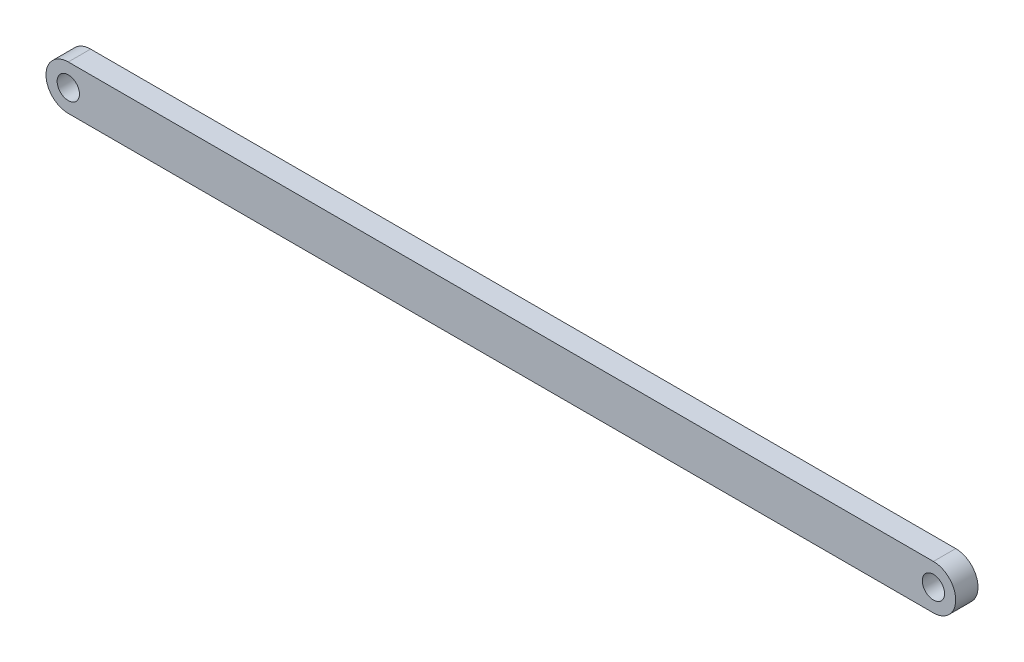
ISO-10303-21;
HEADER;
FILE_DESCRIPTION(('STEP AP214'),'2;1');
FILE_NAME('part.step','',(''),(''),'','','');
FILE_SCHEMA(('AUTOMOTIVE_DESIGN { 1 0 10303 214 1 1 1 1 }'));
ENDSEC;
DATA;
#1=APPLICATION_CONTEXT('core data for automotive mechanical design processes');
#2=APPLICATION_PROTOCOL_DEFINITION('international standard','automotive_design',2000,#1);
#3=PRODUCT_CONTEXT('',#1,'mechanical');
#4=PRODUCT('Part','Part','',(#3));
#5=PRODUCT_RELATED_PRODUCT_CATEGORY('part','',(#4));
#6=PRODUCT_DEFINITION_FORMATION('','',#4);
#7=PRODUCT_DEFINITION_CONTEXT('part definition',#1,'design');
#8=PRODUCT_DEFINITION('design','',#6,#7);
#9=PRODUCT_DEFINITION_SHAPE('','',#8);
#10=(LENGTH_UNIT() NAMED_UNIT(*) SI_UNIT(.MILLI.,.METRE.));
#11=(NAMED_UNIT(*) PLANE_ANGLE_UNIT() SI_UNIT($,.RADIAN.));
#12=(NAMED_UNIT(*) SI_UNIT($,.STERADIAN.) SOLID_ANGLE_UNIT());
#13=UNCERTAINTY_MEASURE_WITH_UNIT(LENGTH_MEASURE(1.E-05),#10,'distance_accuracy_value','');
#14=(GEOMETRIC_REPRESENTATION_CONTEXT(3) GLOBAL_UNCERTAINTY_ASSIGNED_CONTEXT((#13)) GLOBAL_UNIT_ASSIGNED_CONTEXT((#10,
#11,#12)) REPRESENTATION_CONTEXT('',''));
#15=CARTESIAN_POINT('',(0.,0.,0.));
#16=DIRECTION('',(0.,0.,1.));
#17=DIRECTION('',(1.,0.,0.));
#18=AXIS2_PLACEMENT_3D('',#15,#16,#17);
#19=CARTESIAN_POINT('',(388.,0.,10.));
#20=DIRECTION('',(0.,0.,-1.));
#21=DIRECTION('',(-1.,0.,0.));
#22=AXIS2_PLACEMENT_3D('',#19,#20,#21);
#23=CYLINDRICAL_SURFACE('',#22,10.);
#24=CARTESIAN_POINT('',(388.,0.,0.));
#25=DIRECTION('',(0.,0.,-1.));
#26=DIRECTION('',(-1.,0.,0.));
#27=AXIS2_PLACEMENT_3D('',#24,#25,#26);
#28=CIRCLE('',#27,10.);
#29=CARTESIAN_POINT('',(388.,9.99999999999999,0.));
#30=VERTEX_POINT('',#29);
#31=CARTESIAN_POINT('',(388.,-10.,0.));
#32=VERTEX_POINT('',#31);
#33=EDGE_CURVE('E141',#30,#32,#28,.T.);
#34=ORIENTED_EDGE('',*,*,#33,.F.);
#35=DIRECTION('',(0.,0.,-1.));
#36=VECTOR('',#35,1.);
#37=CARTESIAN_POINT('',(388.,9.99999999999999,10.));
#38=LINE('',#37,#36);
#39=CARTESIAN_POINT('',(388.,9.99999999999999,10.));
#40=VERTEX_POINT('',#39);
#41=EDGE_CURVE('E11',#40,#30,#38,.T.);
#42=ORIENTED_EDGE('',*,*,#41,.F.);
#43=CARTESIAN_POINT('',(388.,0.,10.));
#44=DIRECTION('',(0.,0.,-1.));
#45=DIRECTION('',(-1.,0.,0.));
#46=AXIS2_PLACEMENT_3D('',#43,#44,#45);
#47=CIRCLE('',#46,10.);
#48=CARTESIAN_POINT('',(388.,-10.,10.));
#49=VERTEX_POINT('',#48);
#50=EDGE_CURVE('E114',#40,#49,#47,.T.);
#51=ORIENTED_EDGE('',*,*,#50,.T.);
#52=DIRECTION('',(0.,0.,-1.));
#53=VECTOR('',#52,1.);
#54=CARTESIAN_POINT('',(388.,-10.,10.));
#55=LINE('',#54,#53);
#56=EDGE_CURVE('E46',#49,#32,#55,.T.);
#57=ORIENTED_EDGE('',*,*,#56,.T.);
#58=EDGE_LOOP('',(#34,#42,#51,#57));
#59=FACE_BOUND('',#58,.T.);
#60=ADVANCED_FACE('F30',(#59),#23,.T.);
#61=CARTESIAN_POINT('',(-123.871999047463,10.,10.));
#62=DIRECTION('',(0.,-1.,0.));
#63=DIRECTION('',(1.,0.,0.));
#64=AXIS2_PLACEMENT_3D('',#61,#62,#63);
#65=PLANE('',#64);
#66=DIRECTION('',(-1.,0.,0.));
#67=VECTOR('',#66,1.);
#68=CARTESIAN_POINT('',(-123.871999047463,10.,0.));
#69=LINE('',#68,#67);
#70=CARTESIAN_POINT('',(0.,10.,0.));
#71=VERTEX_POINT('',#70);
#72=EDGE_CURVE('E138',#30,#71,#69,.T.);
#73=ORIENTED_EDGE('',*,*,#72,.T.);
#74=DIRECTION('',(0.,0.,-1.));
#75=VECTOR('',#74,1.);
#76=CARTESIAN_POINT('',(0.,10.,10.));
#77=LINE('',#76,#75);
#78=CARTESIAN_POINT('',(0.,10.,10.));
#79=VERTEX_POINT('',#78);
#80=EDGE_CURVE('E38',#79,#71,#77,.T.);
#81=ORIENTED_EDGE('',*,*,#80,.F.);
#82=DIRECTION('',(-1.,0.,0.));
#83=VECTOR('',#82,1.);
#84=CARTESIAN_POINT('',(-123.871999047463,10.,10.));
#85=LINE('',#84,#83);
#86=EDGE_CURVE('E112',#40,#79,#85,.T.);
#87=ORIENTED_EDGE('',*,*,#86,.F.);
#88=ORIENTED_EDGE('',*,*,#41,.T.);
#89=EDGE_LOOP('',(#73,#81,#87,#88));
#90=FACE_BOUND('',#89,.T.);
#91=ADVANCED_FACE('F139',(#90),#65,.F.);
#92=CARTESIAN_POINT('',(0.,0.,10.));
#93=DIRECTION('',(0.,0.,-1.));
#94=DIRECTION('',(-1.,0.,0.));
#95=AXIS2_PLACEMENT_3D('',#92,#93,#94);
#96=CYLINDRICAL_SURFACE('',#95,10.);
#97=CARTESIAN_POINT('',(0.,0.,0.));
#98=DIRECTION('',(0.,0.,-1.));
#99=DIRECTION('',(-1.,0.,0.));
#100=AXIS2_PLACEMENT_3D('',#97,#98,#99);
#101=CIRCLE('',#100,10.);
#102=CARTESIAN_POINT('',(-9.99999999999999,0.000999999999928142,0.));
#103=VERTEX_POINT('',#102);
#104=EDGE_CURVE('E135',#103,#71,#101,.T.);
#105=ORIENTED_EDGE('',*,*,#104,.F.);
#106=DIRECTION('',(0.,0.,-1.));
#107=VECTOR('',#106,1.);
#108=CARTESIAN_POINT('',(-9.99999999999999,0.000999999999928142,10.));
#109=LINE('',#108,#107);
#110=CARTESIAN_POINT('',(-9.99999999999999,0.000999999999928142,10.));
#111=VERTEX_POINT('',#110);
#112=EDGE_CURVE('E93',#111,#103,#109,.T.);
#113=ORIENTED_EDGE('',*,*,#112,.F.);
#114=CARTESIAN_POINT('',(0.,0.,10.));
#115=DIRECTION('',(0.,0.,-1.));
#116=DIRECTION('',(-1.,0.,0.));
#117=AXIS2_PLACEMENT_3D('',#114,#115,#116);
#118=CIRCLE('',#117,10.);
#119=EDGE_CURVE('E104',#111,#79,#118,.T.);
#120=ORIENTED_EDGE('',*,*,#119,.T.);
#121=ORIENTED_EDGE('',*,*,#80,.T.);
#122=EDGE_LOOP('',(#105,#113,#120,#121));
#123=FACE_BOUND('',#122,.T.);
#124=ADVANCED_FACE('F133',(#123),#96,.T.);
#125=CARTESIAN_POINT('',(-9.99999999999999,0.,10.));
#126=DIRECTION('',(-1.,0.,0.));
#127=DIRECTION('',(0.,0.,1.));
#128=AXIS2_PLACEMENT_3D('',#125,#126,#127);
#129=PLANE('',#128);
#130=DIRECTION('',(0.,1.,0.));
#131=VECTOR('',#130,1.);
#132=CARTESIAN_POINT('',(-9.99999999999999,0.,0.));
#133=LINE('',#132,#131);
#134=CARTESIAN_POINT('',(-9.99999999999999,0.,0.));
#135=VERTEX_POINT('',#134);
#136=EDGE_CURVE('E89',#135,#103,#133,.T.);
#137=ORIENTED_EDGE('',*,*,#136,.F.);
#138=DIRECTION('',(0.,0.,-1.));
#139=VECTOR('',#138,1.);
#140=CARTESIAN_POINT('',(-9.99999999999999,0.,10.));
#141=LINE('',#140,#139);
#142=CARTESIAN_POINT('',(-9.99999999999999,0.,10.));
#143=VERTEX_POINT('',#142);
#144=EDGE_CURVE('E84',#143,#135,#141,.T.);
#145=ORIENTED_EDGE('',*,*,#144,.F.);
#146=DIRECTION('',(0.,1.,0.));
#147=VECTOR('',#146,1.);
#148=CARTESIAN_POINT('',(-9.99999999999999,0.,10.));
#149=LINE('',#148,#147);
#150=EDGE_CURVE('E87',#143,#111,#149,.T.);
#151=ORIENTED_EDGE('',*,*,#150,.T.);
#152=ORIENTED_EDGE('',*,*,#112,.T.);
#153=EDGE_LOOP('',(#137,#145,#151,#152));
#154=FACE_BOUND('',#153,.T.);
#155=ADVANCED_FACE('F86',(#154),#129,.T.);
#156=CARTESIAN_POINT('',(0.,-10.,0.));
#157=VERTEX_POINT('',#156);
#158=EDGE_CURVE('E146',#157,#135,#101,.T.);
#159=ORIENTED_EDGE('',*,*,#158,.F.);
#160=DIRECTION('',(0.,0.,-1.));
#161=VECTOR('',#160,1.);
#162=CARTESIAN_POINT('',(0.,-10.,10.));
#163=LINE('',#162,#161);
#164=CARTESIAN_POINT('',(0.,-10.,10.));
#165=VERTEX_POINT('',#164);
#166=EDGE_CURVE('E65',#165,#157,#163,.T.);
#167=ORIENTED_EDGE('',*,*,#166,.F.);
#168=EDGE_CURVE('E102',#165,#143,#118,.T.);
#169=ORIENTED_EDGE('',*,*,#168,.T.);
#170=ORIENTED_EDGE('',*,*,#144,.T.);
#171=EDGE_LOOP('',(#159,#167,#169,#170));
#172=FACE_BOUND('',#171,.T.);
#173=ADVANCED_FACE('F106',(#172),#96,.T.);
#174=CARTESIAN_POINT('',(0.,0.,10.));
#175=DIRECTION('',(0.,0.,-1.));
#176=DIRECTION('',(-1.,0.,0.));
#177=AXIS2_PLACEMENT_3D('',#174,#175,#176);
#178=CYLINDRICAL_SURFACE('',#177,5.);
#179=CARTESIAN_POINT('',(0.,0.,10.));
#180=DIRECTION('',(0.,0.,-1.));
#181=DIRECTION('',(-1.,0.,0.));
#182=AXIS2_PLACEMENT_3D('',#179,#180,#181);
#183=CIRCLE('',#182,5.);
#184=CARTESIAN_POINT('',(-5.,0.,10.));
#185=VERTEX_POINT('',#184);
#186=EDGE_CURVE('E109',#185,#185,#183,.T.);
#187=ORIENTED_EDGE('',*,*,#186,.F.);
#188=EDGE_LOOP('',(#187));
#189=FACE_BOUND('',#188,.T.);
#190=CARTESIAN_POINT('',(0.,0.,0.));
#191=DIRECTION('',(0.,0.,-1.));
#192=DIRECTION('',(-1.,0.,0.));
#193=AXIS2_PLACEMENT_3D('',#190,#191,#192);
#194=CIRCLE('',#193,5.);
#195=CARTESIAN_POINT('',(-5.,0.,0.));
#196=VERTEX_POINT('',#195);
#197=EDGE_CURVE('E119',#196,#196,#194,.T.);
#198=ORIENTED_EDGE('',*,*,#197,.T.);
#199=EDGE_LOOP('',(#198));
#200=FACE_BOUND('',#199,.T.);
#201=ADVANCED_FACE('F152',(#189,#200),#178,.F.);
#202=CARTESIAN_POINT('',(-123.871999047463,-10.,10.));
#203=DIRECTION('',(0.,-1.,0.));
#204=DIRECTION('',(1.,0.,0.));
#205=AXIS2_PLACEMENT_3D('',#202,#203,#204);
#206=PLANE('',#205);
#207=DIRECTION('',(-1.,0.,0.));
#208=VECTOR('',#207,1.);
#209=CARTESIAN_POINT('',(-123.871999047463,-10.,0.));
#210=LINE('',#209,#208);
#211=EDGE_CURVE('E124',#32,#157,#210,.T.);
#212=ORIENTED_EDGE('',*,*,#211,.F.);
#213=ORIENTED_EDGE('',*,*,#56,.F.);
#214=DIRECTION('',(-1.,0.,0.));
#215=VECTOR('',#214,1.);
#216=CARTESIAN_POINT('',(-123.871999047463,-10.,10.));
#217=LINE('',#216,#215);
#218=EDGE_CURVE('E107',#49,#165,#217,.T.);
#219=ORIENTED_EDGE('',*,*,#218,.T.);
#220=ORIENTED_EDGE('',*,*,#166,.T.);
#221=EDGE_LOOP('',(#212,#213,#219,#220));
#222=FACE_BOUND('',#221,.T.);
#223=ADVANCED_FACE('F149',(#222),#206,.T.);
#224=CARTESIAN_POINT('',(388.,0.,10.));
#225=DIRECTION('',(0.,0.,-1.));
#226=DIRECTION('',(-1.,0.,0.));
#227=AXIS2_PLACEMENT_3D('',#224,#225,#226);
#228=CYLINDRICAL_SURFACE('',#227,4.99999999999999);
#229=CARTESIAN_POINT('',(388.,0.,10.));
#230=DIRECTION('',(0.,0.,-1.));
#231=DIRECTION('',(-1.,0.,0.));
#232=AXIS2_PLACEMENT_3D('',#229,#230,#231);
#233=CIRCLE('',#232,4.99999999999999);
#234=CARTESIAN_POINT('',(383.,0.,10.));
#235=VERTEX_POINT('',#234);
#236=EDGE_CURVE('E129',#235,#235,#233,.T.);
#237=ORIENTED_EDGE('',*,*,#236,.F.);
#238=EDGE_LOOP('',(#237));
#239=FACE_BOUND('',#238,.T.);
#240=CARTESIAN_POINT('',(388.,0.,0.));
#241=DIRECTION('',(0.,0.,-1.));
#242=DIRECTION('',(-1.,0.,0.));
#243=AXIS2_PLACEMENT_3D('',#240,#241,#242);
#244=CIRCLE('',#243,4.99999999999999);
#245=CARTESIAN_POINT('',(383.,0.,0.));
#246=VERTEX_POINT('',#245);
#247=EDGE_CURVE('E116',#246,#246,#244,.T.);
#248=ORIENTED_EDGE('',*,*,#247,.T.);
#249=EDGE_LOOP('',(#248));
#250=FACE_BOUND('',#249,.T.);
#251=ADVANCED_FACE('F151',(#239,#250),#228,.F.);
#252=CARTESIAN_POINT('',(-123.871999047463,0.,10.));
#253=DIRECTION('',(0.,0.,-1.));
#254=DIRECTION('',(-1.,0.,0.));
#255=AXIS2_PLACEMENT_3D('',#252,#253,#254);
#256=PLANE('',#255);
#257=ORIENTED_EDGE('',*,*,#50,.F.);
#258=ORIENTED_EDGE('',*,*,#86,.T.);
#259=ORIENTED_EDGE('',*,*,#119,.F.);
#260=ORIENTED_EDGE('',*,*,#150,.F.);
#261=ORIENTED_EDGE('',*,*,#168,.F.);
#262=ORIENTED_EDGE('',*,*,#218,.F.);
#263=EDGE_LOOP('',(#257,#258,#259,#260,#261,#262));
#264=FACE_BOUND('',#263,.T.);
#265=ORIENTED_EDGE('',*,*,#186,.T.);
#266=EDGE_LOOP('',(#265));
#267=FACE_BOUND('',#266,.T.);
#268=ORIENTED_EDGE('',*,*,#236,.T.);
#269=EDGE_LOOP('',(#268));
#270=FACE_BOUND('',#269,.T.);
#271=ADVANCED_FACE('F99',(#264,#267,#270),#256,.F.);
#272=CARTESIAN_POINT('',(-123.871999047463,0.,0.));
#273=DIRECTION('',(0.,0.,-1.));
#274=DIRECTION('',(-1.,0.,0.));
#275=AXIS2_PLACEMENT_3D('',#272,#273,#274);
#276=PLANE('',#275);
#277=ORIENTED_EDGE('',*,*,#33,.T.);
#278=ORIENTED_EDGE('',*,*,#211,.T.);
#279=ORIENTED_EDGE('',*,*,#158,.T.);
#280=ORIENTED_EDGE('',*,*,#136,.T.);
#281=ORIENTED_EDGE('',*,*,#104,.T.);
#282=ORIENTED_EDGE('',*,*,#72,.F.);
#283=EDGE_LOOP('',(#277,#278,#279,#280,#281,#282));
#284=FACE_BOUND('',#283,.T.);
#285=ORIENTED_EDGE('',*,*,#197,.F.);
#286=EDGE_LOOP('',(#285));
#287=FACE_BOUND('',#286,.T.);
#288=ORIENTED_EDGE('',*,*,#247,.F.);
#289=EDGE_LOOP('',(#288));
#290=FACE_BOUND('',#289,.T.);
#291=ADVANCED_FACE('F143',(#284,#287,#290),#276,.T.);
#292=CLOSED_SHELL('',(#60,#91,#124,#155,#173,#201,#223,#251,#271,#291));
#293=MANIFOLD_SOLID_BREP('B2',#292);
#294=ADVANCED_BREP_SHAPE_REPRESENTATION('',(#18,#293),#14);
#295=SHAPE_DEFINITION_REPRESENTATION(#9,#294);
ENDSEC;
END-ISO-10303-21;
